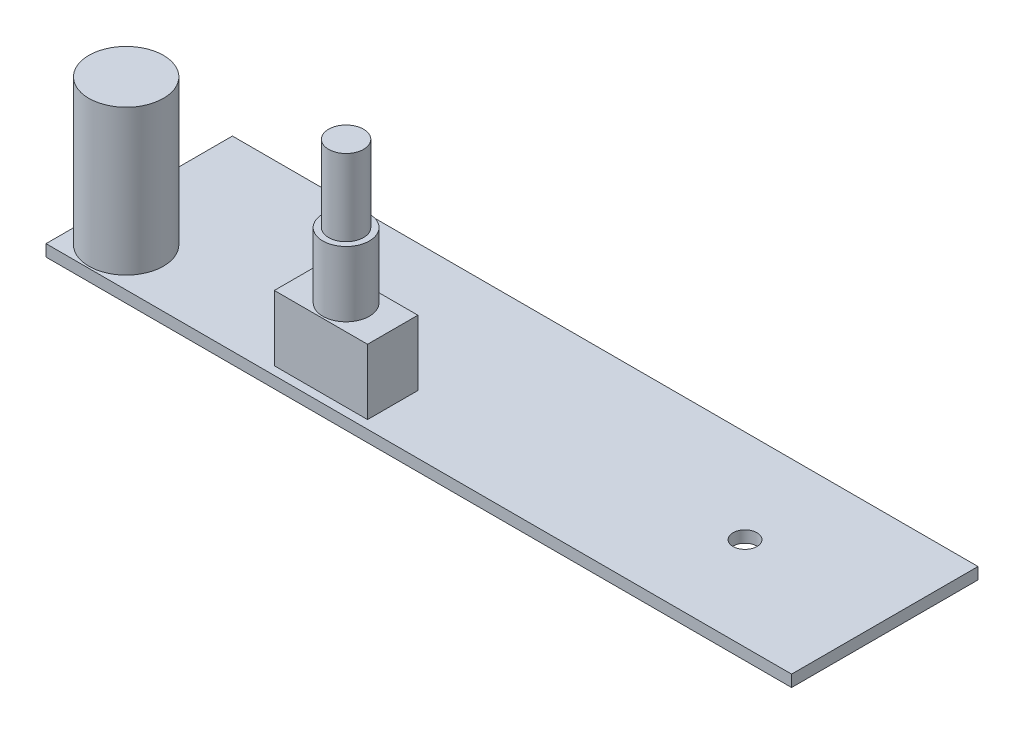
ISO-10303-21;
HEADER;
FILE_DESCRIPTION(('STEP AP214'),'2;1');
FILE_NAME('part.step','',(''),(''),'','','');
FILE_SCHEMA(('AUTOMOTIVE_DESIGN { 1 0 10303 214 1 1 1 1 }'));
ENDSEC;
DATA;
#1=APPLICATION_CONTEXT('core data for automotive mechanical design processes');
#2=APPLICATION_PROTOCOL_DEFINITION('international standard','automotive_design',2000,#1);
#3=PRODUCT_CONTEXT('',#1,'mechanical');
#4=PRODUCT('Part','Part','',(#3));
#5=PRODUCT_RELATED_PRODUCT_CATEGORY('part','',(#4));
#6=PRODUCT_DEFINITION_FORMATION('','',#4);
#7=PRODUCT_DEFINITION_CONTEXT('part definition',#1,'design');
#8=PRODUCT_DEFINITION('design','',#6,#7);
#9=PRODUCT_DEFINITION_SHAPE('','',#8);
#10=(LENGTH_UNIT() NAMED_UNIT(*) SI_UNIT(.MILLI.,.METRE.));
#11=(NAMED_UNIT(*) PLANE_ANGLE_UNIT() SI_UNIT($,.RADIAN.));
#12=(NAMED_UNIT(*) SI_UNIT($,.STERADIAN.) SOLID_ANGLE_UNIT());
#13=UNCERTAINTY_MEASURE_WITH_UNIT(LENGTH_MEASURE(1.E-05),#10,'distance_accuracy_value','');
#14=(GEOMETRIC_REPRESENTATION_CONTEXT(3) GLOBAL_UNCERTAINTY_ASSIGNED_CONTEXT((#13)) GLOBAL_UNIT_ASSIGNED_CONTEXT((#10,
#11,#12)) REPRESENTATION_CONTEXT('',''));
#15=CARTESIAN_POINT('',(0.,0.,0.));
#16=DIRECTION('',(0.,0.,1.));
#17=DIRECTION('',(1.,0.,0.));
#18=AXIS2_PLACEMENT_3D('',#15,#16,#17);
#19=CARTESIAN_POINT('',(0.,1.5875,0.));
#20=DIRECTION('',(0.,-1.,0.));
#21=DIRECTION('',(0.,0.,-1.));
#22=AXIS2_PLACEMENT_3D('',#19,#20,#21);
#23=PLANE('',#22);
#24=DIRECTION('',(0.,0.,1.));
#25=VECTOR('',#24,1.);
#26=CARTESIAN_POINT('',(0.,1.5875,0.));
#27=LINE('',#26,#25);
#28=CARTESIAN_POINT('',(0.,1.5875,-25.4));
#29=VERTEX_POINT('',#28);
#30=CARTESIAN_POINT('',(0.,1.5875,0.));
#31=VERTEX_POINT('',#30);
#32=EDGE_CURVE('E143',#29,#31,#27,.T.);
#33=ORIENTED_EDGE('',*,*,#32,.T.);
#34=DIRECTION('',(1.,0.,0.));
#35=VECTOR('',#34,1.);
#36=CARTESIAN_POINT('',(0.,1.5875,0.));
#37=LINE('',#36,#35);
#38=CARTESIAN_POINT('',(101.6,1.5875,0.));
#39=VERTEX_POINT('',#38);
#40=EDGE_CURVE('E146',#31,#39,#37,.T.);
#41=ORIENTED_EDGE('',*,*,#40,.T.);
#42=DIRECTION('',(0.,0.,-1.));
#43=VECTOR('',#42,1.);
#44=CARTESIAN_POINT('',(101.6,1.5875,0.));
#45=LINE('',#44,#43);
#46=CARTESIAN_POINT('',(101.6,1.5875,-25.4));
#47=VERTEX_POINT('',#46);
#48=EDGE_CURVE('E149',#39,#47,#45,.T.);
#49=ORIENTED_EDGE('',*,*,#48,.T.);
#50=DIRECTION('',(-1.,0.,0.));
#51=VECTOR('',#50,1.);
#52=CARTESIAN_POINT('',(0.,1.5875,-25.4));
#53=LINE('',#52,#51);
#54=EDGE_CURVE('E151',#47,#29,#53,.T.);
#55=ORIENTED_EDGE('',*,*,#54,.T.);
#56=EDGE_LOOP('',(#33,#41,#49,#55));
#57=FACE_BOUND('',#56,.T.);
#58=CARTESIAN_POINT('',(82.55,1.5875,-12.7));
#59=DIRECTION('',(0.,1.,0.));
#60=DIRECTION('',(0.,0.,1.));
#61=AXIS2_PLACEMENT_3D('',#58,#59,#60);
#62=CIRCLE('',#61,1.63194999999999);
#63=CARTESIAN_POINT('',(82.55,1.5875,-11.06805));
#64=VERTEX_POINT('',#63);
#65=EDGE_CURVE('E136',#64,#64,#62,.T.);
#66=ORIENTED_EDGE('',*,*,#65,.F.);
#67=EDGE_LOOP('',(#66));
#68=FACE_BOUND('',#67,.T.);
#69=CARTESIAN_POINT('',(31.75,1.5875,-12.7));
#70=DIRECTION('',(0.,1.,0.));
#71=DIRECTION('',(0.,0.,1.));
#72=AXIS2_PLACEMENT_3D('',#69,#70,#71);
#73=CIRCLE('',#72,1.63194999999999);
#74=CARTESIAN_POINT('',(31.75,1.5875,-11.06805));
#75=VERTEX_POINT('',#74);
#76=EDGE_CURVE('E125',#75,#75,#73,.T.);
#77=ORIENTED_EDGE('',*,*,#76,.F.);
#78=EDGE_LOOP('',(#77));
#79=FACE_BOUND('',#78,.T.);
#80=CARTESIAN_POINT('',(5.588,1.5875,-5.334));
#81=DIRECTION('',(0.,-1.,0.));
#82=DIRECTION('',(0.,0.,-1.));
#83=AXIS2_PLACEMENT_3D('',#80,#81,#82);
#84=CIRCLE('',#83,5.08);
#85=CARTESIAN_POINT('',(5.588,1.5875,-10.414));
#86=VERTEX_POINT('',#85);
#87=EDGE_CURVE('E44',#86,#86,#84,.F.);
#88=ORIENTED_EDGE('',*,*,#87,.F.);
#89=EDGE_LOOP('',(#88));
#90=FACE_BOUND('',#89,.T.);
#91=DIRECTION('',(0.,0.,1.));
#92=VECTOR('',#91,1.);
#93=CARTESIAN_POINT('',(29.972,1.5875,-8.001));
#94=LINE('',#93,#92);
#95=CARTESIAN_POINT('',(29.972,1.5875,-8.001));
#96=VERTEX_POINT('',#95);
#97=CARTESIAN_POINT('',(29.972,1.5875,-1.143));
#98=VERTEX_POINT('',#97);
#99=EDGE_CURVE('E121',#96,#98,#94,.T.);
#100=ORIENTED_EDGE('',*,*,#99,.F.);
#101=DIRECTION('',(-1.,0.,0.));
#102=VECTOR('',#101,1.);
#103=CARTESIAN_POINT('',(42.672,1.5875,-8.001));
#104=LINE('',#103,#102);
#105=CARTESIAN_POINT('',(42.672,1.5875,-8.001));
#106=VERTEX_POINT('',#105);
#107=EDGE_CURVE('E118',#106,#96,#104,.T.);
#108=ORIENTED_EDGE('',*,*,#107,.F.);
#109=DIRECTION('',(0.,0.,-1.));
#110=VECTOR('',#109,1.);
#111=CARTESIAN_POINT('',(42.672,1.5875,-8.001));
#112=LINE('',#111,#110);
#113=CARTESIAN_POINT('',(42.672,1.5875,-1.143));
#114=VERTEX_POINT('',#113);
#115=EDGE_CURVE('E56',#114,#106,#112,.T.);
#116=ORIENTED_EDGE('',*,*,#115,.F.);
#117=DIRECTION('',(1.,0.,0.));
#118=VECTOR('',#117,1.);
#119=CARTESIAN_POINT('',(42.672,1.5875,-1.143));
#120=LINE('',#119,#118);
#121=EDGE_CURVE('E51',#98,#114,#120,.T.);
#122=ORIENTED_EDGE('',*,*,#121,.F.);
#123=EDGE_LOOP('',(#100,#108,#116,#122));
#124=FACE_BOUND('',#123,.T.);
#125=ADVANCED_FACE('F36',(#57,#68,#79,#90,#124),#23,.F.);
#126=CARTESIAN_POINT('',(0.,1.5875,0.));
#127=DIRECTION('',(1.,0.,0.));
#128=DIRECTION('',(0.,0.,-1.));
#129=AXIS2_PLACEMENT_3D('',#126,#127,#128);
#130=PLANE('',#129);
#131=DIRECTION('',(0.,0.,1.));
#132=VECTOR('',#131,1.);
#133=CARTESIAN_POINT('',(0.,0.,0.));
#134=LINE('',#133,#132);
#135=CARTESIAN_POINT('',(0.,0.,-25.4));
#136=VERTEX_POINT('',#135);
#137=CARTESIAN_POINT('',(0.,0.,0.));
#138=VERTEX_POINT('',#137);
#139=EDGE_CURVE('E142',#136,#138,#134,.T.);
#140=ORIENTED_EDGE('',*,*,#139,.T.);
#141=DIRECTION('',(0.,-1.,0.));
#142=VECTOR('',#141,1.);
#143=CARTESIAN_POINT('',(0.,1.5875,0.));
#144=LINE('',#143,#142);
#145=EDGE_CURVE('E169',#31,#138,#144,.T.);
#146=ORIENTED_EDGE('',*,*,#145,.F.);
#147=ORIENTED_EDGE('',*,*,#32,.F.);
#148=DIRECTION('',(0.,-1.,0.));
#149=VECTOR('',#148,1.);
#150=CARTESIAN_POINT('',(0.,1.5875,-25.4));
#151=LINE('',#150,#149);
#152=EDGE_CURVE('E153',#29,#136,#151,.T.);
#153=ORIENTED_EDGE('',*,*,#152,.T.);
#154=EDGE_LOOP('',(#140,#146,#147,#153));
#155=FACE_BOUND('',#154,.T.);
#156=ADVANCED_FACE('F38',(#155),#130,.F.);
#157=CARTESIAN_POINT('',(0.,1.5875,0.));
#158=DIRECTION('',(0.,0.,-1.));
#159=DIRECTION('',(-1.,0.,0.));
#160=AXIS2_PLACEMENT_3D('',#157,#158,#159);
#161=PLANE('',#160);
#162=DIRECTION('',(1.,0.,0.));
#163=VECTOR('',#162,1.);
#164=CARTESIAN_POINT('',(0.,0.,0.));
#165=LINE('',#164,#163);
#166=CARTESIAN_POINT('',(101.6,0.,0.));
#167=VERTEX_POINT('',#166);
#168=EDGE_CURVE('E156',#138,#167,#165,.T.);
#169=ORIENTED_EDGE('',*,*,#168,.T.);
#170=DIRECTION('',(0.,-1.,0.));
#171=VECTOR('',#170,1.);
#172=CARTESIAN_POINT('',(101.6,1.5875,0.));
#173=LINE('',#172,#171);
#174=EDGE_CURVE('E166',#39,#167,#173,.T.);
#175=ORIENTED_EDGE('',*,*,#174,.F.);
#176=ORIENTED_EDGE('',*,*,#40,.F.);
#177=ORIENTED_EDGE('',*,*,#145,.T.);
#178=EDGE_LOOP('',(#169,#175,#176,#177));
#179=FACE_BOUND('',#178,.T.);
#180=ADVANCED_FACE('F263',(#179),#161,.F.);
#181=CARTESIAN_POINT('',(101.6,1.5875,0.));
#182=DIRECTION('',(-1.,0.,0.));
#183=DIRECTION('',(0.,0.,1.));
#184=AXIS2_PLACEMENT_3D('',#181,#182,#183);
#185=PLANE('',#184);
#186=DIRECTION('',(0.,0.,-1.));
#187=VECTOR('',#186,1.);
#188=CARTESIAN_POINT('',(101.6,0.,0.));
#189=LINE('',#188,#187);
#190=CARTESIAN_POINT('',(101.6,0.,-25.4));
#191=VERTEX_POINT('',#190);
#192=EDGE_CURVE('E158',#167,#191,#189,.T.);
#193=ORIENTED_EDGE('',*,*,#192,.T.);
#194=DIRECTION('',(0.,-1.,0.));
#195=VECTOR('',#194,1.);
#196=CARTESIAN_POINT('',(101.6,1.5875,-25.4));
#197=LINE('',#196,#195);
#198=EDGE_CURVE('E163',#47,#191,#197,.T.);
#199=ORIENTED_EDGE('',*,*,#198,.F.);
#200=ORIENTED_EDGE('',*,*,#48,.F.);
#201=ORIENTED_EDGE('',*,*,#174,.T.);
#202=EDGE_LOOP('',(#193,#199,#200,#201));
#203=FACE_BOUND('',#202,.T.);
#204=ADVANCED_FACE('F260',(#203),#185,.F.);
#205=CARTESIAN_POINT('',(0.,1.5875,-25.4));
#206=DIRECTION('',(0.,0.,1.));
#207=DIRECTION('',(1.,0.,0.));
#208=AXIS2_PLACEMENT_3D('',#205,#206,#207);
#209=PLANE('',#208);
#210=DIRECTION('',(-1.,0.,0.));
#211=VECTOR('',#210,1.);
#212=CARTESIAN_POINT('',(0.,0.,-25.4));
#213=LINE('',#212,#211);
#214=EDGE_CURVE('E147',#191,#136,#213,.T.);
#215=ORIENTED_EDGE('',*,*,#214,.T.);
#216=ORIENTED_EDGE('',*,*,#152,.F.);
#217=ORIENTED_EDGE('',*,*,#54,.F.);
#218=ORIENTED_EDGE('',*,*,#198,.T.);
#219=EDGE_LOOP('',(#215,#216,#217,#218));
#220=FACE_BOUND('',#219,.T.);
#221=ADVANCED_FACE('F256',(#220),#209,.F.);
#222=CARTESIAN_POINT('',(0.,0.,0.));
#223=DIRECTION('',(0.,-1.,0.));
#224=DIRECTION('',(0.,0.,-1.));
#225=AXIS2_PLACEMENT_3D('',#222,#223,#224);
#226=PLANE('',#225);
#227=CARTESIAN_POINT('',(31.75,0.,-12.7));
#228=DIRECTION('',(0.,-1.,0.));
#229=DIRECTION('',(0.,0.,-1.));
#230=AXIS2_PLACEMENT_3D('',#227,#228,#229);
#231=CIRCLE('',#230,1.63194999999999);
#232=CARTESIAN_POINT('',(31.75,0.,-14.33195));
#233=VERTEX_POINT('',#232);
#234=EDGE_CURVE('E133',#233,#233,#231,.T.);
#235=ORIENTED_EDGE('',*,*,#234,.F.);
#236=EDGE_LOOP('',(#235));
#237=FACE_BOUND('',#236,.T.);
#238=CARTESIAN_POINT('',(82.55,0.,-12.7));
#239=DIRECTION('',(0.,-1.,0.));
#240=DIRECTION('',(0.,0.,-1.));
#241=AXIS2_PLACEMENT_3D('',#238,#239,#240);
#242=CIRCLE('',#241,1.63194999999999);
#243=CARTESIAN_POINT('',(82.55,0.,-14.33195));
#244=VERTEX_POINT('',#243);
#245=EDGE_CURVE('E139',#244,#244,#242,.T.);
#246=ORIENTED_EDGE('',*,*,#245,.F.);
#247=EDGE_LOOP('',(#246));
#248=FACE_BOUND('',#247,.T.);
#249=ORIENTED_EDGE('',*,*,#139,.F.);
#250=ORIENTED_EDGE('',*,*,#214,.F.);
#251=ORIENTED_EDGE('',*,*,#192,.F.);
#252=ORIENTED_EDGE('',*,*,#168,.F.);
#253=EDGE_LOOP('',(#249,#250,#251,#252));
#254=FACE_BOUND('',#253,.T.);
#255=ADVANCED_FACE('F251',(#237,#248,#254),#226,.T.);
#256=CARTESIAN_POINT('',(82.55,1.5875,-12.7));
#257=DIRECTION('',(0.,1.,0.));
#258=DIRECTION('',(0.,0.,1.));
#259=AXIS2_PLACEMENT_3D('',#256,#257,#258);
#260=CYLINDRICAL_SURFACE('',#259,1.63194999999999);
#261=ORIENTED_EDGE('',*,*,#65,.T.);
#262=EDGE_LOOP('',(#261));
#263=FACE_BOUND('',#262,.T.);
#264=ORIENTED_EDGE('',*,*,#245,.T.);
#265=EDGE_LOOP('',(#264));
#266=FACE_BOUND('',#265,.T.);
#267=ADVANCED_FACE('F248',(#263,#266),#260,.F.);
#268=CARTESIAN_POINT('',(31.75,1.5875,-12.7));
#269=DIRECTION('',(0.,1.,0.));
#270=DIRECTION('',(0.,0.,1.));
#271=AXIS2_PLACEMENT_3D('',#268,#269,#270);
#272=CYLINDRICAL_SURFACE('',#271,1.63194999999999);
#273=ORIENTED_EDGE('',*,*,#76,.T.);
#274=EDGE_LOOP('',(#273));
#275=FACE_BOUND('',#274,.T.);
#276=ORIENTED_EDGE('',*,*,#234,.T.);
#277=EDGE_LOOP('',(#276));
#278=FACE_BOUND('',#277,.T.);
#279=ADVANCED_FACE('F244',(#275,#278),#272,.F.);
#280=CARTESIAN_POINT('',(5.588,21.3995,-5.334));
#281=DIRECTION('',(0.,-1.,0.));
#282=DIRECTION('',(0.,0.,-1.));
#283=AXIS2_PLACEMENT_3D('',#280,#281,#282);
#284=CYLINDRICAL_SURFACE('',#283,5.08);
#285=CARTESIAN_POINT('',(5.588,21.3995,-5.334));
#286=DIRECTION('',(0.,1.,0.));
#287=DIRECTION('',(0.,0.,1.));
#288=AXIS2_PLACEMENT_3D('',#285,#286,#287);
#289=CIRCLE('',#288,5.08);
#290=CARTESIAN_POINT('',(5.588,21.3995,-0.253999999999997));
#291=VERTEX_POINT('',#290);
#292=EDGE_CURVE('E122',#291,#291,#289,.T.);
#293=ORIENTED_EDGE('',*,*,#292,.F.);
#294=EDGE_LOOP('',(#293));
#295=FACE_BOUND('',#294,.T.);
#296=ORIENTED_EDGE('',*,*,#87,.T.);
#297=EDGE_LOOP('',(#296));
#298=FACE_BOUND('',#297,.T.);
#299=ADVANCED_FACE('F174',(#295,#298),#284,.T.);
#300=CARTESIAN_POINT('',(5.588,21.3995,-5.334));
#301=DIRECTION('',(0.,1.,0.));
#302=DIRECTION('',(0.,0.,1.));
#303=AXIS2_PLACEMENT_3D('',#300,#301,#302);
#304=PLANE('',#303);
#305=ORIENTED_EDGE('',*,*,#292,.T.);
#306=EDGE_LOOP('',(#305));
#307=FACE_BOUND('',#306,.T.);
#308=ADVANCED_FACE('F238',(#307),#304,.T.);
#309=CARTESIAN_POINT('',(29.972,10.4775,-8.001));
#310=DIRECTION('',(1.,0.,0.));
#311=DIRECTION('',(0.,0.,-1.));
#312=AXIS2_PLACEMENT_3D('',#309,#310,#311);
#313=PLANE('',#312);
#314=ORIENTED_EDGE('',*,*,#99,.T.);
#315=DIRECTION('',(0.,-1.,0.));
#316=VECTOR('',#315,1.);
#317=CARTESIAN_POINT('',(29.972,10.4775,-1.143));
#318=LINE('',#317,#316);
#319=CARTESIAN_POINT('',(29.972,10.4775,-1.143));
#320=VERTEX_POINT('',#319);
#321=EDGE_CURVE('E102',#320,#98,#318,.T.);
#322=ORIENTED_EDGE('',*,*,#321,.F.);
#323=DIRECTION('',(0.,0.,1.));
#324=VECTOR('',#323,1.);
#325=CARTESIAN_POINT('',(29.972,10.4775,-8.001));
#326=LINE('',#325,#324);
#327=CARTESIAN_POINT('',(29.972,10.4775,-8.001));
#328=VERTEX_POINT('',#327);
#329=EDGE_CURVE('E109',#328,#320,#326,.T.);
#330=ORIENTED_EDGE('',*,*,#329,.F.);
#331=DIRECTION('',(0.,-1.,0.));
#332=VECTOR('',#331,1.);
#333=CARTESIAN_POINT('',(29.972,10.4775,-8.001));
#334=LINE('',#333,#332);
#335=EDGE_CURVE('E185',#328,#96,#334,.T.);
#336=ORIENTED_EDGE('',*,*,#335,.T.);
#337=EDGE_LOOP('',(#314,#322,#330,#336));
#338=FACE_BOUND('',#337,.T.);
#339=ADVANCED_FACE('F120',(#338),#313,.F.);
#340=CARTESIAN_POINT('',(42.672,10.4775,-1.143));
#341=DIRECTION('',(0.,0.,-1.));
#342=DIRECTION('',(-1.,0.,0.));
#343=AXIS2_PLACEMENT_3D('',#340,#341,#342);
#344=PLANE('',#343);
#345=ORIENTED_EDGE('',*,*,#121,.T.);
#346=DIRECTION('',(0.,-1.,0.));
#347=VECTOR('',#346,1.);
#348=CARTESIAN_POINT('',(42.672,10.4775,-1.143));
#349=LINE('',#348,#347);
#350=CARTESIAN_POINT('',(42.672,10.4775,-1.143));
#351=VERTEX_POINT('',#350);
#352=EDGE_CURVE('E105',#351,#114,#349,.T.);
#353=ORIENTED_EDGE('',*,*,#352,.F.);
#354=DIRECTION('',(1.,0.,0.));
#355=VECTOR('',#354,1.);
#356=CARTESIAN_POINT('',(42.672,10.4775,-1.143));
#357=LINE('',#356,#355);
#358=EDGE_CURVE('E98',#320,#351,#357,.T.);
#359=ORIENTED_EDGE('',*,*,#358,.F.);
#360=ORIENTED_EDGE('',*,*,#321,.T.);
#361=EDGE_LOOP('',(#345,#353,#359,#360));
#362=FACE_BOUND('',#361,.T.);
#363=ADVANCED_FACE('F100',(#362),#344,.F.);
#364=CARTESIAN_POINT('',(42.672,10.4775,-8.001));
#365=DIRECTION('',(-1.,0.,0.));
#366=DIRECTION('',(0.,0.,1.));
#367=AXIS2_PLACEMENT_3D('',#364,#365,#366);
#368=PLANE('',#367);
#369=ORIENTED_EDGE('',*,*,#115,.T.);
#370=DIRECTION('',(0.,-1.,0.));
#371=VECTOR('',#370,1.);
#372=CARTESIAN_POINT('',(42.672,10.4775,-8.001));
#373=LINE('',#372,#371);
#374=CARTESIAN_POINT('',(42.672,10.4775,-8.001));
#375=VERTEX_POINT('',#374);
#376=EDGE_CURVE('E127',#375,#106,#373,.T.);
#377=ORIENTED_EDGE('',*,*,#376,.F.);
#378=DIRECTION('',(0.,0.,-1.));
#379=VECTOR('',#378,1.);
#380=CARTESIAN_POINT('',(42.672,10.4775,-8.001));
#381=LINE('',#380,#379);
#382=EDGE_CURVE('E108',#351,#375,#381,.T.);
#383=ORIENTED_EDGE('',*,*,#382,.F.);
#384=ORIENTED_EDGE('',*,*,#352,.T.);
#385=EDGE_LOOP('',(#369,#377,#383,#384));
#386=FACE_BOUND('',#385,.T.);
#387=ADVANCED_FACE('F228',(#386),#368,.F.);
#388=CARTESIAN_POINT('',(42.672,10.4775,-8.001));
#389=DIRECTION('',(0.,0.,1.));
#390=DIRECTION('',(1.,0.,0.));
#391=AXIS2_PLACEMENT_3D('',#388,#389,#390);
#392=PLANE('',#391);
#393=ORIENTED_EDGE('',*,*,#107,.T.);
#394=ORIENTED_EDGE('',*,*,#335,.F.);
#395=DIRECTION('',(-1.,0.,0.));
#396=VECTOR('',#395,1.);
#397=CARTESIAN_POINT('',(42.672,10.4775,-8.001));
#398=LINE('',#397,#396);
#399=EDGE_CURVE('E114',#375,#328,#398,.T.);
#400=ORIENTED_EDGE('',*,*,#399,.F.);
#401=ORIENTED_EDGE('',*,*,#376,.T.);
#402=EDGE_LOOP('',(#393,#394,#400,#401));
#403=FACE_BOUND('',#402,.T.);
#404=ADVANCED_FACE('F184',(#403),#392,.F.);
#405=CARTESIAN_POINT('',(0.,10.4775,0.));
#406=DIRECTION('',(0.,-1.,0.));
#407=DIRECTION('',(0.,0.,-1.));
#408=AXIS2_PLACEMENT_3D('',#405,#406,#407);
#409=PLANE('',#408);
#410=CARTESIAN_POINT('',(36.322,10.4775,-4.572));
#411=DIRECTION('',(0.,-1.,0.));
#412=DIRECTION('',(0.,0.,-1.));
#413=AXIS2_PLACEMENT_3D('',#410,#411,#412);
#414=CIRCLE('',#413,3.175);
#415=CARTESIAN_POINT('',(36.322,10.4775,-7.747));
#416=VERTEX_POINT('',#415);
#417=EDGE_CURVE('E11',#416,#416,#414,.F.);
#418=ORIENTED_EDGE('',*,*,#417,.F.);
#419=EDGE_LOOP('',(#418));
#420=FACE_BOUND('',#419,.T.);
#421=ORIENTED_EDGE('',*,*,#329,.T.);
#422=ORIENTED_EDGE('',*,*,#358,.T.);
#423=ORIENTED_EDGE('',*,*,#382,.T.);
#424=ORIENTED_EDGE('',*,*,#399,.T.);
#425=EDGE_LOOP('',(#421,#422,#423,#424));
#426=FACE_BOUND('',#425,.T.);
#427=ADVANCED_FACE('F112',(#420,#426),#409,.F.);
#428=CARTESIAN_POINT('',(36.322,19.3675,-4.572));
#429=DIRECTION('',(0.,-1.,0.));
#430=DIRECTION('',(0.,0.,-1.));
#431=AXIS2_PLACEMENT_3D('',#428,#429,#430);
#432=CYLINDRICAL_SURFACE('',#431,3.175);
#433=CARTESIAN_POINT('',(36.322,19.3675,-4.572));
#434=DIRECTION('',(0.,1.,0.));
#435=DIRECTION('',(0.,0.,1.));
#436=AXIS2_PLACEMENT_3D('',#433,#434,#435);
#437=CIRCLE('',#436,3.175);
#438=CARTESIAN_POINT('',(36.322,19.3675,-1.397));
#439=VERTEX_POINT('',#438);
#440=EDGE_CURVE('E180',#439,#439,#437,.T.);
#441=ORIENTED_EDGE('',*,*,#440,.F.);
#442=EDGE_LOOP('',(#441));
#443=FACE_BOUND('',#442,.T.);
#444=ORIENTED_EDGE('',*,*,#417,.T.);
#445=EDGE_LOOP('',(#444));
#446=FACE_BOUND('',#445,.T.);
#447=ADVANCED_FACE('F214',(#443,#446),#432,.T.);
#448=CARTESIAN_POINT('',(0.,19.3675,0.));
#449=DIRECTION('',(0.,1.,0.));
#450=DIRECTION('',(0.,0.,1.));
#451=AXIS2_PLACEMENT_3D('',#448,#449,#450);
#452=PLANE('',#451);
#453=CARTESIAN_POINT('',(36.322,19.3675,-4.572));
#454=DIRECTION('',(0.,1.,0.));
#455=DIRECTION('',(0.,0.,1.));
#456=AXIS2_PLACEMENT_3D('',#453,#454,#455);
#457=CIRCLE('',#456,2.38125);
#458=CARTESIAN_POINT('',(36.322,19.3675,-2.19075));
#459=VERTEX_POINT('',#458);
#460=EDGE_CURVE('E197',#459,#459,#457,.T.);
#461=ORIENTED_EDGE('',*,*,#460,.F.);
#462=EDGE_LOOP('',(#461));
#463=FACE_BOUND('',#462,.T.);
#464=ORIENTED_EDGE('',*,*,#440,.T.);
#465=EDGE_LOOP('',(#464));
#466=FACE_BOUND('',#465,.T.);
#467=ADVANCED_FACE('F208',(#463,#466),#452,.T.);
#468=CARTESIAN_POINT('',(36.322,29.7815,-4.572));
#469=DIRECTION('',(0.,-1.,0.));
#470=DIRECTION('',(0.,0.,-1.));
#471=AXIS2_PLACEMENT_3D('',#468,#469,#470);
#472=CYLINDRICAL_SURFACE('',#471,2.38125);
#473=CARTESIAN_POINT('',(36.322,29.7815,-4.572));
#474=DIRECTION('',(0.,1.,0.));
#475=DIRECTION('',(0.,0.,1.));
#476=AXIS2_PLACEMENT_3D('',#473,#474,#475);
#477=CIRCLE('',#476,2.38125);
#478=CARTESIAN_POINT('',(36.322,29.7815,-2.19075));
#479=VERTEX_POINT('',#478);
#480=EDGE_CURVE('E196',#479,#479,#477,.T.);
#481=ORIENTED_EDGE('',*,*,#480,.F.);
#482=EDGE_LOOP('',(#481));
#483=FACE_BOUND('',#482,.T.);
#484=ORIENTED_EDGE('',*,*,#460,.T.);
#485=EDGE_LOOP('',(#484));
#486=FACE_BOUND('',#485,.T.);
#487=ADVANCED_FACE('F205',(#483,#486),#472,.T.);
#488=CARTESIAN_POINT('',(36.322,29.7815,-4.572));
#489=DIRECTION('',(0.,1.,0.));
#490=DIRECTION('',(0.,0.,1.));
#491=AXIS2_PLACEMENT_3D('',#488,#489,#490);
#492=PLANE('',#491);
#493=ORIENTED_EDGE('',*,*,#480,.T.);
#494=EDGE_LOOP('',(#493));
#495=FACE_BOUND('',#494,.T.);
#496=ADVANCED_FACE('F203',(#495),#492,.T.);
#497=CLOSED_SHELL('',(#125,#156,#180,#204,#221,#255,#267,#279,#299,#308,#339,#363,#387,#404,
#427,#447,#467,#487,#496));
#498=MANIFOLD_SOLID_BREP('B2',#497);
#499=ADVANCED_BREP_SHAPE_REPRESENTATION('',(#18,#498),#14);
#500=SHAPE_DEFINITION_REPRESENTATION(#9,#499);
ENDSEC;
END-ISO-10303-21;
